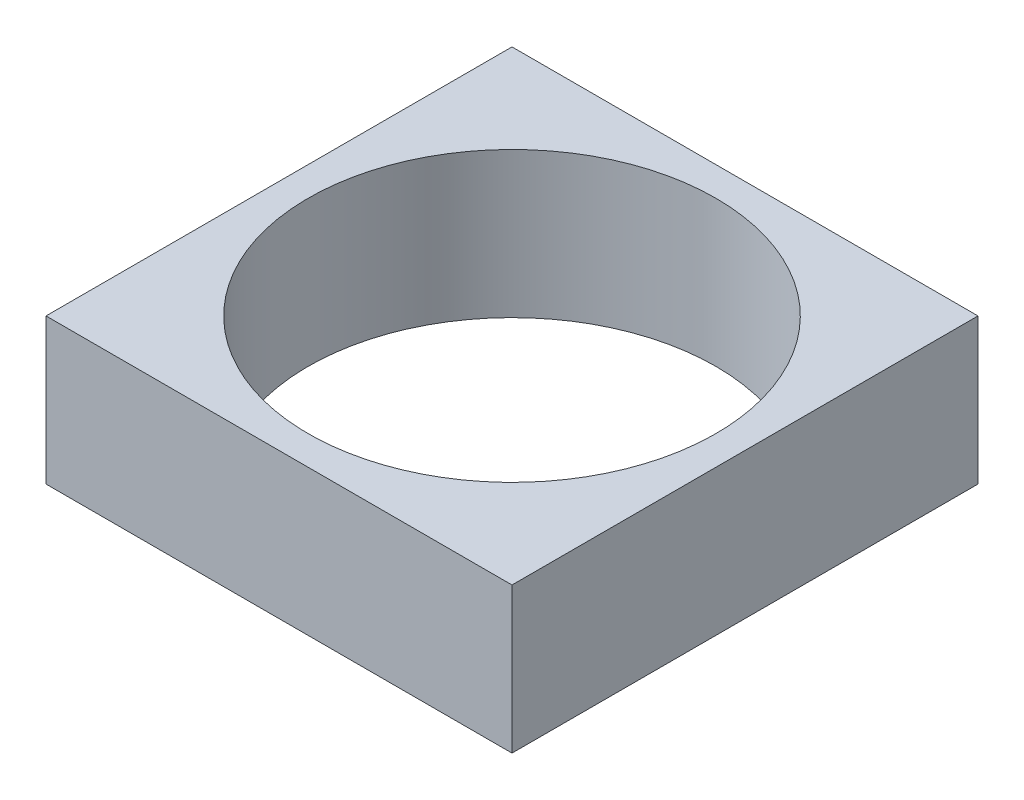
ISO-10303-21;
HEADER;
FILE_DESCRIPTION(('STEP AP214'),'2;1');
FILE_NAME('part.step','',(''),(''),'','','');
FILE_SCHEMA(('AUTOMOTIVE_DESIGN { 1 0 10303 214 1 1 1 1 }'));
ENDSEC;
DATA;
#1=APPLICATION_CONTEXT('core data for automotive mechanical design processes');
#2=APPLICATION_PROTOCOL_DEFINITION('international standard','automotive_design',2000,#1);
#3=PRODUCT_CONTEXT('',#1,'mechanical');
#4=PRODUCT('Part','Part','',(#3));
#5=PRODUCT_RELATED_PRODUCT_CATEGORY('part','',(#4));
#6=PRODUCT_DEFINITION_FORMATION('','',#4);
#7=PRODUCT_DEFINITION_CONTEXT('part definition',#1,'design');
#8=PRODUCT_DEFINITION('design','',#6,#7);
#9=PRODUCT_DEFINITION_SHAPE('','',#8);
#10=(LENGTH_UNIT() NAMED_UNIT(*) SI_UNIT(.MILLI.,.METRE.));
#11=(NAMED_UNIT(*) PLANE_ANGLE_UNIT() SI_UNIT($,.RADIAN.));
#12=(NAMED_UNIT(*) SI_UNIT($,.STERADIAN.) SOLID_ANGLE_UNIT());
#13=UNCERTAINTY_MEASURE_WITH_UNIT(LENGTH_MEASURE(1.E-05),#10,'distance_accuracy_value','');
#14=(GEOMETRIC_REPRESENTATION_CONTEXT(3) GLOBAL_UNCERTAINTY_ASSIGNED_CONTEXT((#13)) GLOBAL_UNIT_ASSIGNED_CONTEXT((#10,
#11,#12)) REPRESENTATION_CONTEXT('',''));
#15=CARTESIAN_POINT('',(0.,0.,0.));
#16=DIRECTION('',(0.,0.,1.));
#17=DIRECTION('',(1.,0.,0.));
#18=AXIS2_PLACEMENT_3D('',#15,#16,#17);
#19=CARTESIAN_POINT('',(40.,25.,-40.));
#20=DIRECTION('',(-1.,0.,0.));
#21=DIRECTION('',(0.,0.,1.));
#22=AXIS2_PLACEMENT_3D('',#19,#20,#21);
#23=PLANE('',#22);
#24=DIRECTION('',(0.,0.,-1.));
#25=VECTOR('',#24,1.);
#26=CARTESIAN_POINT('',(40.,0.,-40.));
#27=LINE('',#26,#25);
#28=CARTESIAN_POINT('',(40.,0.,40.));
#29=VERTEX_POINT('',#28);
#30=CARTESIAN_POINT('',(40.,0.,-40.));
#31=VERTEX_POINT('',#30);
#32=EDGE_CURVE('E96',#29,#31,#27,.T.);
#33=ORIENTED_EDGE('',*,*,#32,.T.);
#34=DIRECTION('',(0.,-1.,0.));
#35=VECTOR('',#34,1.);
#36=CARTESIAN_POINT('',(40.,25.,-40.));
#37=LINE('',#36,#35);
#38=CARTESIAN_POINT('',(40.,25.,-40.));
#39=VERTEX_POINT('',#38);
#40=EDGE_CURVE('E11',#39,#31,#37,.T.);
#41=ORIENTED_EDGE('',*,*,#40,.F.);
#42=DIRECTION('',(0.,0.,-1.));
#43=VECTOR('',#42,1.);
#44=CARTESIAN_POINT('',(40.,25.,-40.));
#45=LINE('',#44,#43);
#46=CARTESIAN_POINT('',(40.,25.,40.));
#47=VERTEX_POINT('',#46);
#48=EDGE_CURVE('E84',#47,#39,#45,.T.);
#49=ORIENTED_EDGE('',*,*,#48,.F.);
#50=DIRECTION('',(0.,-1.,0.));
#51=VECTOR('',#50,1.);
#52=CARTESIAN_POINT('',(40.,25.,40.));
#53=LINE('',#52,#51);
#54=EDGE_CURVE('E92',#47,#29,#53,.T.);
#55=ORIENTED_EDGE('',*,*,#54,.T.);
#56=EDGE_LOOP('',(#33,#41,#49,#55));
#57=FACE_BOUND('',#56,.T.);
#58=ADVANCED_FACE('F33',(#57),#23,.F.);
#59=CARTESIAN_POINT('',(-40.,25.,-40.));
#60=DIRECTION('',(0.,0.,1.));
#61=DIRECTION('',(1.,0.,0.));
#62=AXIS2_PLACEMENT_3D('',#59,#60,#61);
#63=PLANE('',#62);
#64=DIRECTION('',(-1.,0.,0.));
#65=VECTOR('',#64,1.);
#66=CARTESIAN_POINT('',(-40.,0.,-40.));
#67=LINE('',#66,#65);
#68=CARTESIAN_POINT('',(-40.,0.,-40.));
#69=VERTEX_POINT('',#68);
#70=EDGE_CURVE('E88',#31,#69,#67,.T.);
#71=ORIENTED_EDGE('',*,*,#70,.T.);
#72=DIRECTION('',(0.,-1.,0.));
#73=VECTOR('',#72,1.);
#74=CARTESIAN_POINT('',(-40.,25.,-40.));
#75=LINE('',#74,#73);
#76=CARTESIAN_POINT('',(-40.,25.,-40.));
#77=VERTEX_POINT('',#76);
#78=EDGE_CURVE('E41',#77,#69,#75,.T.);
#79=ORIENTED_EDGE('',*,*,#78,.F.);
#80=DIRECTION('',(-1.,0.,0.));
#81=VECTOR('',#80,1.);
#82=CARTESIAN_POINT('',(-40.,25.,-40.));
#83=LINE('',#82,#81);
#84=EDGE_CURVE('E79',#39,#77,#83,.T.);
#85=ORIENTED_EDGE('',*,*,#84,.F.);
#86=ORIENTED_EDGE('',*,*,#40,.T.);
#87=EDGE_LOOP('',(#71,#79,#85,#86));
#88=FACE_BOUND('',#87,.T.);
#89=ADVANCED_FACE('F87',(#88),#63,.F.);
#90=CARTESIAN_POINT('',(-40.,25.,-40.));
#91=DIRECTION('',(1.,0.,0.));
#92=DIRECTION('',(0.,0.,-1.));
#93=AXIS2_PLACEMENT_3D('',#90,#91,#92);
#94=PLANE('',#93);
#95=DIRECTION('',(0.,0.,1.));
#96=VECTOR('',#95,1.);
#97=CARTESIAN_POINT('',(-40.,0.,-40.));
#98=LINE('',#97,#96);
#99=CARTESIAN_POINT('',(-40.,0.,40.));
#100=VERTEX_POINT('',#99);
#101=EDGE_CURVE('E66',#69,#100,#98,.T.);
#102=ORIENTED_EDGE('',*,*,#101,.T.);
#103=DIRECTION('',(0.,-1.,0.));
#104=VECTOR('',#103,1.);
#105=CARTESIAN_POINT('',(-40.,25.,40.));
#106=LINE('',#105,#104);
#107=CARTESIAN_POINT('',(-40.,25.,40.));
#108=VERTEX_POINT('',#107);
#109=EDGE_CURVE('E89',#108,#100,#106,.T.);
#110=ORIENTED_EDGE('',*,*,#109,.F.);
#111=DIRECTION('',(0.,0.,1.));
#112=VECTOR('',#111,1.);
#113=CARTESIAN_POINT('',(-40.,25.,-40.));
#114=LINE('',#113,#112);
#115=EDGE_CURVE('E82',#77,#108,#114,.T.);
#116=ORIENTED_EDGE('',*,*,#115,.F.);
#117=ORIENTED_EDGE('',*,*,#78,.T.);
#118=EDGE_LOOP('',(#102,#110,#116,#117));
#119=FACE_BOUND('',#118,.T.);
#120=ADVANCED_FACE('F90',(#119),#94,.F.);
#121=CARTESIAN_POINT('',(-40.,25.,40.));
#122=DIRECTION('',(0.,0.,-1.));
#123=DIRECTION('',(-1.,0.,0.));
#124=AXIS2_PLACEMENT_3D('',#121,#122,#123);
#125=PLANE('',#124);
#126=DIRECTION('',(1.,0.,0.));
#127=VECTOR('',#126,1.);
#128=CARTESIAN_POINT('',(-40.,0.,40.));
#129=LINE('',#128,#127);
#130=EDGE_CURVE('E72',#100,#29,#129,.T.);
#131=ORIENTED_EDGE('',*,*,#130,.T.);
#132=ORIENTED_EDGE('',*,*,#54,.F.);
#133=DIRECTION('',(1.,0.,0.));
#134=VECTOR('',#133,1.);
#135=CARTESIAN_POINT('',(-40.,25.,40.));
#136=LINE('',#135,#134);
#137=EDGE_CURVE('E49',#108,#47,#136,.T.);
#138=ORIENTED_EDGE('',*,*,#137,.F.);
#139=ORIENTED_EDGE('',*,*,#109,.T.);
#140=EDGE_LOOP('',(#131,#132,#138,#139));
#141=FACE_BOUND('',#140,.T.);
#142=ADVANCED_FACE('F104',(#141),#125,.F.);
#143=CARTESIAN_POINT('',(0.,25.,0.));
#144=DIRECTION('',(0.,1.,0.));
#145=DIRECTION('',(0.,0.,1.));
#146=AXIS2_PLACEMENT_3D('',#143,#144,#145);
#147=PLANE('',#146);
#148=CARTESIAN_POINT('',(0.,25.,0.));
#149=DIRECTION('',(0.,-1.,0.));
#150=DIRECTION('',(0.,0.,-1.));
#151=AXIS2_PLACEMENT_3D('',#148,#149,#150);
#152=CIRCLE('',#151,35.);
#153=CARTESIAN_POINT('',(0.,25.,-35.));
#154=VERTEX_POINT('',#153);
#155=EDGE_CURVE('E99',#154,#154,#152,.T.);
#156=ORIENTED_EDGE('',*,*,#155,.T.);
#157=EDGE_LOOP('',(#156));
#158=FACE_BOUND('',#157,.T.);
#159=ORIENTED_EDGE('',*,*,#48,.T.);
#160=ORIENTED_EDGE('',*,*,#84,.T.);
#161=ORIENTED_EDGE('',*,*,#115,.T.);
#162=ORIENTED_EDGE('',*,*,#137,.T.);
#163=EDGE_LOOP('',(#159,#160,#161,#162));
#164=FACE_BOUND('',#163,.T.);
#165=ADVANCED_FACE('F80',(#158,#164),#147,.T.);
#166=CARTESIAN_POINT('',(0.,0.,0.));
#167=DIRECTION('',(0.,1.,0.));
#168=DIRECTION('',(0.,0.,1.));
#169=AXIS2_PLACEMENT_3D('',#166,#167,#168);
#170=PLANE('',#169);
#171=CARTESIAN_POINT('',(0.,0.,0.));
#172=DIRECTION('',(0.,-1.,0.));
#173=DIRECTION('',(0.,0.,-1.));
#174=AXIS2_PLACEMENT_3D('',#171,#172,#173);
#175=CIRCLE('',#174,35.);
#176=CARTESIAN_POINT('',(0.,0.,-35.));
#177=VERTEX_POINT('',#176);
#178=EDGE_CURVE('E110',#177,#177,#175,.T.);
#179=ORIENTED_EDGE('',*,*,#178,.F.);
#180=EDGE_LOOP('',(#179));
#181=FACE_BOUND('',#180,.T.);
#182=ORIENTED_EDGE('',*,*,#32,.F.);
#183=ORIENTED_EDGE('',*,*,#130,.F.);
#184=ORIENTED_EDGE('',*,*,#101,.F.);
#185=ORIENTED_EDGE('',*,*,#70,.F.);
#186=EDGE_LOOP('',(#182,#183,#184,#185));
#187=FACE_BOUND('',#186,.T.);
#188=ADVANCED_FACE('F107',(#181,#187),#170,.F.);
#189=CARTESIAN_POINT('',(0.,25.,0.));
#190=DIRECTION('',(0.,-1.,0.));
#191=DIRECTION('',(0.,0.,-1.));
#192=AXIS2_PLACEMENT_3D('',#189,#190,#191);
#193=CYLINDRICAL_SURFACE('',#192,35.);
#194=ORIENTED_EDGE('',*,*,#155,.F.);
#195=EDGE_LOOP('',(#194));
#196=FACE_BOUND('',#195,.T.);
#197=ORIENTED_EDGE('',*,*,#178,.T.);
#198=EDGE_LOOP('',(#197));
#199=FACE_BOUND('',#198,.T.);
#200=ADVANCED_FACE('F117',(#196,#199),#193,.F.);
#201=CLOSED_SHELL('',(#58,#89,#120,#142,#165,#188,#200));
#202=MANIFOLD_SOLID_BREP('B2',#201);
#203=ADVANCED_BREP_SHAPE_REPRESENTATION('',(#18,#202),#14);
#204=SHAPE_DEFINITION_REPRESENTATION(#9,#203);
ENDSEC;
END-ISO-10303-21;
